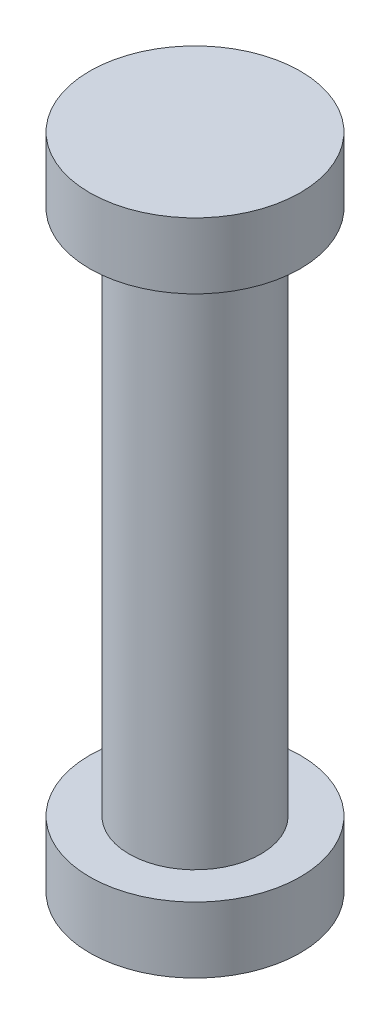
ISO-10303-21;
HEADER;
FILE_DESCRIPTION(('STEP AP214'),'2;1');
FILE_NAME('part.step','',(''),(''),'','','');
FILE_SCHEMA(('AUTOMOTIVE_DESIGN { 1 0 10303 214 1 1 1 1 }'));
ENDSEC;
DATA;
#1=APPLICATION_CONTEXT('core data for automotive mechanical design processes');
#2=APPLICATION_PROTOCOL_DEFINITION('international standard','automotive_design',2000,#1);
#3=PRODUCT_CONTEXT('',#1,'mechanical');
#4=PRODUCT('Part','Part','',(#3));
#5=PRODUCT_RELATED_PRODUCT_CATEGORY('part','',(#4));
#6=PRODUCT_DEFINITION_FORMATION('','',#4);
#7=PRODUCT_DEFINITION_CONTEXT('part definition',#1,'design');
#8=PRODUCT_DEFINITION('design','',#6,#7);
#9=PRODUCT_DEFINITION_SHAPE('','',#8);
#10=(LENGTH_UNIT() NAMED_UNIT(*) SI_UNIT(.MILLI.,.METRE.));
#11=(NAMED_UNIT(*) PLANE_ANGLE_UNIT() SI_UNIT($,.RADIAN.));
#12=(NAMED_UNIT(*) SI_UNIT($,.STERADIAN.) SOLID_ANGLE_UNIT());
#13=UNCERTAINTY_MEASURE_WITH_UNIT(LENGTH_MEASURE(1.E-05),#10,'distance_accuracy_value','');
#14=(GEOMETRIC_REPRESENTATION_CONTEXT(3) GLOBAL_UNCERTAINTY_ASSIGNED_CONTEXT((#13)) GLOBAL_UNIT_ASSIGNED_CONTEXT((#10,
#11,#12)) REPRESENTATION_CONTEXT('',''));
#15=CARTESIAN_POINT('',(0.,0.,0.));
#16=DIRECTION('',(0.,0.,1.));
#17=DIRECTION('',(1.,0.,0.));
#18=AXIS2_PLACEMENT_3D('',#15,#16,#17);
#19=CARTESIAN_POINT('',(0.,40.,0.));
#20=DIRECTION('',(0.,-1.,0.));
#21=DIRECTION('',(0.,0.,-1.));
#22=AXIS2_PLACEMENT_3D('',#19,#20,#21);
#23=CYLINDRICAL_SURFACE('',#22,5.);
#24=CARTESIAN_POINT('',(0.,40.,0.));
#25=DIRECTION('',(0.,1.,0.));
#26=DIRECTION('',(0.,0.,1.));
#27=AXIS2_PLACEMENT_3D('',#24,#25,#26);
#28=CIRCLE('',#27,5.);
#29=CARTESIAN_POINT('',(0.,40.,5.));
#30=VERTEX_POINT('',#29);
#31=EDGE_CURVE('E10',#30,#30,#28,.T.);
#32=ORIENTED_EDGE('',*,*,#31,.F.);
#33=EDGE_LOOP('',(#32));
#34=FACE_BOUND('',#33,.T.);
#35=CARTESIAN_POINT('',(0.,0.,0.));
#36=DIRECTION('',(0.,1.,0.));
#37=DIRECTION('',(0.,0.,1.));
#38=AXIS2_PLACEMENT_3D('',#35,#36,#37);
#39=CIRCLE('',#38,5.);
#40=CARTESIAN_POINT('',(0.,0.,5.));
#41=VERTEX_POINT('',#40);
#42=EDGE_CURVE('E39',#41,#41,#39,.T.);
#43=ORIENTED_EDGE('',*,*,#42,.T.);
#44=EDGE_LOOP('',(#43));
#45=FACE_BOUND('',#44,.T.);
#46=ADVANCED_FACE('F36',(#34,#45),#23,.T.);
#47=CARTESIAN_POINT('',(0.,-5.,0.));
#48=DIRECTION('',(0.,1.,0.));
#49=DIRECTION('',(0.,0.,1.));
#50=AXIS2_PLACEMENT_3D('',#47,#48,#49);
#51=CYLINDRICAL_SURFACE('',#50,8.);
#52=CARTESIAN_POINT('',(0.,-5.,0.));
#53=DIRECTION('',(0.,-1.,0.));
#54=DIRECTION('',(0.,0.,-1.));
#55=AXIS2_PLACEMENT_3D('',#52,#53,#54);
#56=CIRCLE('',#55,8.);
#57=CARTESIAN_POINT('',(0.,-5.,-8.));
#58=VERTEX_POINT('',#57);
#59=EDGE_CURVE('E49',#58,#58,#56,.T.);
#60=ORIENTED_EDGE('',*,*,#59,.F.);
#61=EDGE_LOOP('',(#60));
#62=FACE_BOUND('',#61,.T.);
#63=CARTESIAN_POINT('',(0.,0.,0.));
#64=DIRECTION('',(0.,-1.,0.));
#65=DIRECTION('',(0.,0.,-1.));
#66=AXIS2_PLACEMENT_3D('',#63,#64,#65);
#67=CIRCLE('',#66,8.);
#68=CARTESIAN_POINT('',(0.,0.,-8.));
#69=VERTEX_POINT('',#68);
#70=EDGE_CURVE('E51',#69,#69,#67,.T.);
#71=ORIENTED_EDGE('',*,*,#70,.T.);
#72=EDGE_LOOP('',(#71));
#73=FACE_BOUND('',#72,.T.);
#74=ADVANCED_FACE('F85',(#62,#73),#51,.T.);
#75=CARTESIAN_POINT('',(0.,-5.,0.));
#76=DIRECTION('',(0.,-1.,0.));
#77=DIRECTION('',(0.,0.,-1.));
#78=AXIS2_PLACEMENT_3D('',#75,#76,#77);
#79=PLANE('',#78);
#80=ORIENTED_EDGE('',*,*,#59,.T.);
#81=EDGE_LOOP('',(#80));
#82=FACE_BOUND('',#81,.T.);
#83=ADVANCED_FACE('F90',(#82),#79,.T.);
#84=CARTESIAN_POINT('',(0.,0.,0.));
#85=DIRECTION('',(0.,-1.,0.));
#86=DIRECTION('',(0.,0.,-1.));
#87=AXIS2_PLACEMENT_3D('',#84,#85,#86);
#88=PLANE('',#87);
#89=ORIENTED_EDGE('',*,*,#42,.F.);
#90=EDGE_LOOP('',(#89));
#91=FACE_BOUND('',#90,.T.);
#92=ORIENTED_EDGE('',*,*,#70,.F.);
#93=EDGE_LOOP('',(#92));
#94=FACE_BOUND('',#93,.T.);
#95=ADVANCED_FACE('F73',(#91,#94),#88,.F.);
#96=CARTESIAN_POINT('',(0.,45.,0.));
#97=DIRECTION('',(0.,-1.,0.));
#98=DIRECTION('',(0.,0.,-1.));
#99=AXIS2_PLACEMENT_3D('',#96,#97,#98);
#100=CYLINDRICAL_SURFACE('',#99,8.);
#101=CARTESIAN_POINT('',(0.,45.,0.));
#102=DIRECTION('',(0.,1.,0.));
#103=DIRECTION('',(0.,0.,1.));
#104=AXIS2_PLACEMENT_3D('',#101,#102,#103);
#105=CIRCLE('',#104,8.);
#106=CARTESIAN_POINT('',(0.,45.,8.));
#107=VERTEX_POINT('',#106);
#108=EDGE_CURVE('E55',#107,#107,#105,.T.);
#109=ORIENTED_EDGE('',*,*,#108,.F.);
#110=EDGE_LOOP('',(#109));
#111=FACE_BOUND('',#110,.T.);
#112=CARTESIAN_POINT('',(0.,40.,0.));
#113=DIRECTION('',(0.,1.,0.));
#114=DIRECTION('',(0.,0.,1.));
#115=AXIS2_PLACEMENT_3D('',#112,#113,#114);
#116=CIRCLE('',#115,8.);
#117=CARTESIAN_POINT('',(0.,40.,8.));
#118=VERTEX_POINT('',#117);
#119=EDGE_CURVE('E59',#118,#118,#116,.T.);
#120=ORIENTED_EDGE('',*,*,#119,.T.);
#121=EDGE_LOOP('',(#120));
#122=FACE_BOUND('',#121,.T.);
#123=ADVANCED_FACE('F70',(#111,#122),#100,.T.);
#124=CARTESIAN_POINT('',(0.,45.,0.));
#125=DIRECTION('',(0.,1.,0.));
#126=DIRECTION('',(0.,0.,1.));
#127=AXIS2_PLACEMENT_3D('',#124,#125,#126);
#128=PLANE('',#127);
#129=ORIENTED_EDGE('',*,*,#108,.T.);
#130=EDGE_LOOP('',(#129));
#131=FACE_BOUND('',#130,.T.);
#132=ADVANCED_FACE('F68',(#131),#128,.T.);
#133=CARTESIAN_POINT('',(0.,40.,0.));
#134=DIRECTION('',(0.,1.,0.));
#135=DIRECTION('',(0.,0.,1.));
#136=AXIS2_PLACEMENT_3D('',#133,#134,#135);
#137=PLANE('',#136);
#138=ORIENTED_EDGE('',*,*,#31,.T.);
#139=EDGE_LOOP('',(#138));
#140=FACE_BOUND('',#139,.T.);
#141=ORIENTED_EDGE('',*,*,#119,.F.);
#142=EDGE_LOOP('',(#141));
#143=FACE_BOUND('',#142,.T.);
#144=ADVANCED_FACE('F77',(#140,#143),#137,.F.);
#145=CLOSED_SHELL('',(#46,#74,#83,#95,#123,#132,#144));
#146=MANIFOLD_SOLID_BREP('B2',#145);
#147=ADVANCED_BREP_SHAPE_REPRESENTATION('',(#18,#146),#14);
#148=SHAPE_DEFINITION_REPRESENTATION(#9,#147);
ENDSEC;
END-ISO-10303-21;
